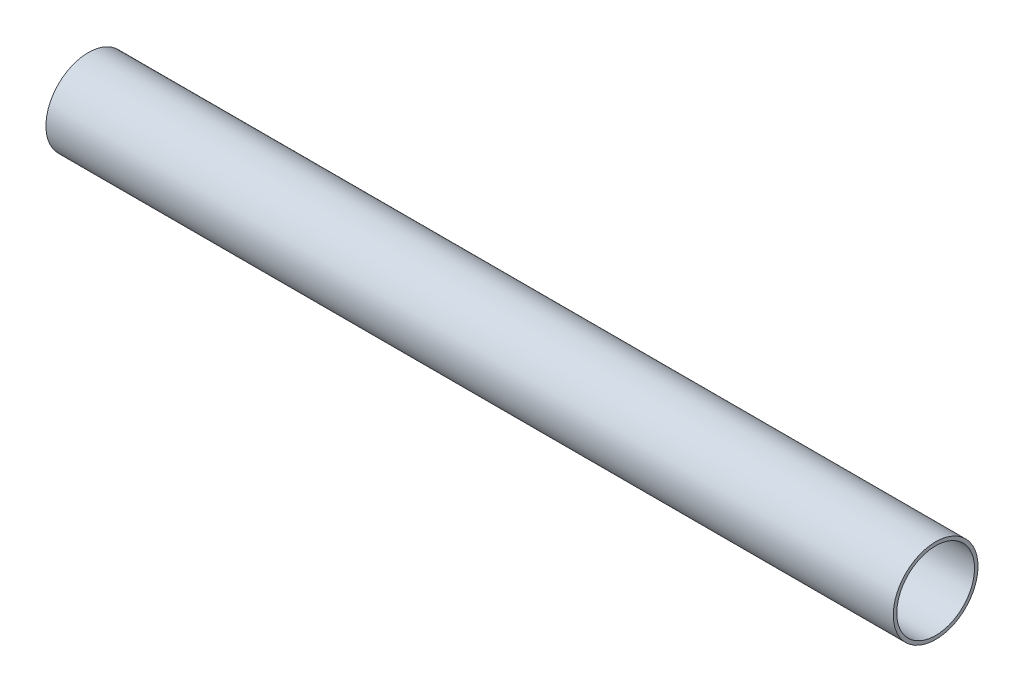
ISO-10303-21;
HEADER;
FILE_DESCRIPTION(('STEP AP214'),'2;1');
FILE_NAME('part.step','',(''),(''),'','','');
FILE_SCHEMA(('AUTOMOTIVE_DESIGN { 1 0 10303 214 1 1 1 1 }'));
ENDSEC;
DATA;
#1=APPLICATION_CONTEXT('core data for automotive mechanical design processes');
#2=APPLICATION_PROTOCOL_DEFINITION('international standard','automotive_design',2000,#1);
#3=PRODUCT_CONTEXT('',#1,'mechanical');
#4=PRODUCT('Part','Part','',(#3));
#5=PRODUCT_RELATED_PRODUCT_CATEGORY('part','',(#4));
#6=PRODUCT_DEFINITION_FORMATION('','',#4);
#7=PRODUCT_DEFINITION_CONTEXT('part definition',#1,'design');
#8=PRODUCT_DEFINITION('design','',#6,#7);
#9=PRODUCT_DEFINITION_SHAPE('','',#8);
#10=(LENGTH_UNIT() NAMED_UNIT(*) SI_UNIT(.MILLI.,.METRE.));
#11=(NAMED_UNIT(*) PLANE_ANGLE_UNIT() SI_UNIT($,.RADIAN.));
#12=(NAMED_UNIT(*) SI_UNIT($,.STERADIAN.) SOLID_ANGLE_UNIT());
#13=UNCERTAINTY_MEASURE_WITH_UNIT(LENGTH_MEASURE(1.E-05),#10,'distance_accuracy_value','');
#14=(GEOMETRIC_REPRESENTATION_CONTEXT(3) GLOBAL_UNCERTAINTY_ASSIGNED_CONTEXT((#13)) GLOBAL_UNIT_ASSIGNED_CONTEXT((#10,
#11,#12)) REPRESENTATION_CONTEXT('',''));
#15=CARTESIAN_POINT('',(0.,0.,0.));
#16=DIRECTION('',(0.,0.,1.));
#17=DIRECTION('',(1.,0.,0.));
#18=AXIS2_PLACEMENT_3D('',#15,#16,#17);
#19=CARTESIAN_POINT('',(160.,0.,0.));
#20=DIRECTION('',(1.,0.,0.));
#21=DIRECTION('',(0.,0.,-1.));
#22=AXIS2_PLACEMENT_3D('',#19,#20,#21);
#23=PLANE('',#22);
#24=CARTESIAN_POINT('',(160.,0.,0.));
#25=DIRECTION('',(1.,0.,0.));
#26=DIRECTION('',(0.,0.,-1.));
#27=AXIS2_PLACEMENT_3D('',#24,#25,#26);
#28=CIRCLE('',#27,16.);
#29=CARTESIAN_POINT('',(160.,0.,-16.));
#30=VERTEX_POINT('',#29);
#31=EDGE_CURVE('E10',#30,#30,#28,.T.);
#32=ORIENTED_EDGE('',*,*,#31,.T.);
#33=EDGE_LOOP('',(#32));
#34=FACE_BOUND('',#33,.T.);
#35=CARTESIAN_POINT('',(160.,0.,0.));
#36=DIRECTION('',(1.,0.,0.));
#37=DIRECTION('',(0.,0.,-1.));
#38=AXIS2_PLACEMENT_3D('',#35,#36,#37);
#39=CIRCLE('',#38,14.68);
#40=CARTESIAN_POINT('',(160.,0.,-14.68));
#41=VERTEX_POINT('',#40);
#42=EDGE_CURVE('E46',#41,#41,#39,.T.);
#43=ORIENTED_EDGE('',*,*,#42,.F.);
#44=EDGE_LOOP('',(#43));
#45=FACE_BOUND('',#44,.T.);
#46=ADVANCED_FACE('F35',(#34,#45),#23,.T.);
#47=CARTESIAN_POINT('',(-160.,0.,0.));
#48=DIRECTION('',(1.,0.,0.));
#49=DIRECTION('',(0.,0.,-1.));
#50=AXIS2_PLACEMENT_3D('',#47,#48,#49);
#51=PLANE('',#50);
#52=CARTESIAN_POINT('',(-160.,0.,0.));
#53=DIRECTION('',(1.,0.,0.));
#54=DIRECTION('',(0.,0.,-1.));
#55=AXIS2_PLACEMENT_3D('',#52,#53,#54);
#56=CIRCLE('',#55,16.);
#57=CARTESIAN_POINT('',(-160.,0.,-16.));
#58=VERTEX_POINT('',#57);
#59=EDGE_CURVE('E39',#58,#58,#56,.T.);
#60=ORIENTED_EDGE('',*,*,#59,.F.);
#61=EDGE_LOOP('',(#60));
#62=FACE_BOUND('',#61,.T.);
#63=CARTESIAN_POINT('',(-160.,0.,0.));
#64=DIRECTION('',(1.,0.,0.));
#65=DIRECTION('',(0.,0.,-1.));
#66=AXIS2_PLACEMENT_3D('',#63,#64,#65);
#67=CIRCLE('',#66,14.68);
#68=CARTESIAN_POINT('',(-160.,0.,-14.68));
#69=VERTEX_POINT('',#68);
#70=EDGE_CURVE('E48',#69,#69,#67,.T.);
#71=ORIENTED_EDGE('',*,*,#70,.T.);
#72=EDGE_LOOP('',(#71));
#73=FACE_BOUND('',#72,.T.);
#74=ADVANCED_FACE('F58',(#62,#73),#51,.F.);
#75=CARTESIAN_POINT('',(160.,0.,0.));
#76=DIRECTION('',(-1.,0.,0.));
#77=DIRECTION('',(0.,0.,1.));
#78=AXIS2_PLACEMENT_3D('',#75,#76,#77);
#79=CYLINDRICAL_SURFACE('',#78,16.);
#80=ORIENTED_EDGE('',*,*,#31,.F.);
#81=EDGE_LOOP('',(#80));
#82=FACE_BOUND('',#81,.T.);
#83=ORIENTED_EDGE('',*,*,#59,.T.);
#84=EDGE_LOOP('',(#83));
#85=FACE_BOUND('',#84,.T.);
#86=ADVANCED_FACE('F37',(#82,#85),#79,.T.);
#87=CARTESIAN_POINT('',(160.,0.,0.));
#88=DIRECTION('',(-1.,0.,0.));
#89=DIRECTION('',(0.,0.,1.));
#90=AXIS2_PLACEMENT_3D('',#87,#88,#89);
#91=CYLINDRICAL_SURFACE('',#90,14.68);
#92=ORIENTED_EDGE('',*,*,#42,.T.);
#93=EDGE_LOOP('',(#92));
#94=FACE_BOUND('',#93,.T.);
#95=ORIENTED_EDGE('',*,*,#70,.F.);
#96=EDGE_LOOP('',(#95));
#97=FACE_BOUND('',#96,.T.);
#98=ADVANCED_FACE('F54',(#94,#97),#91,.F.);
#99=CLOSED_SHELL('',(#46,#74,#86,#98));
#100=MANIFOLD_SOLID_BREP('B2',#99);
#101=ADVANCED_BREP_SHAPE_REPRESENTATION('',(#18,#100),#14);
#102=SHAPE_DEFINITION_REPRESENTATION(#9,#101);
ENDSEC;
END-ISO-10303-21;
